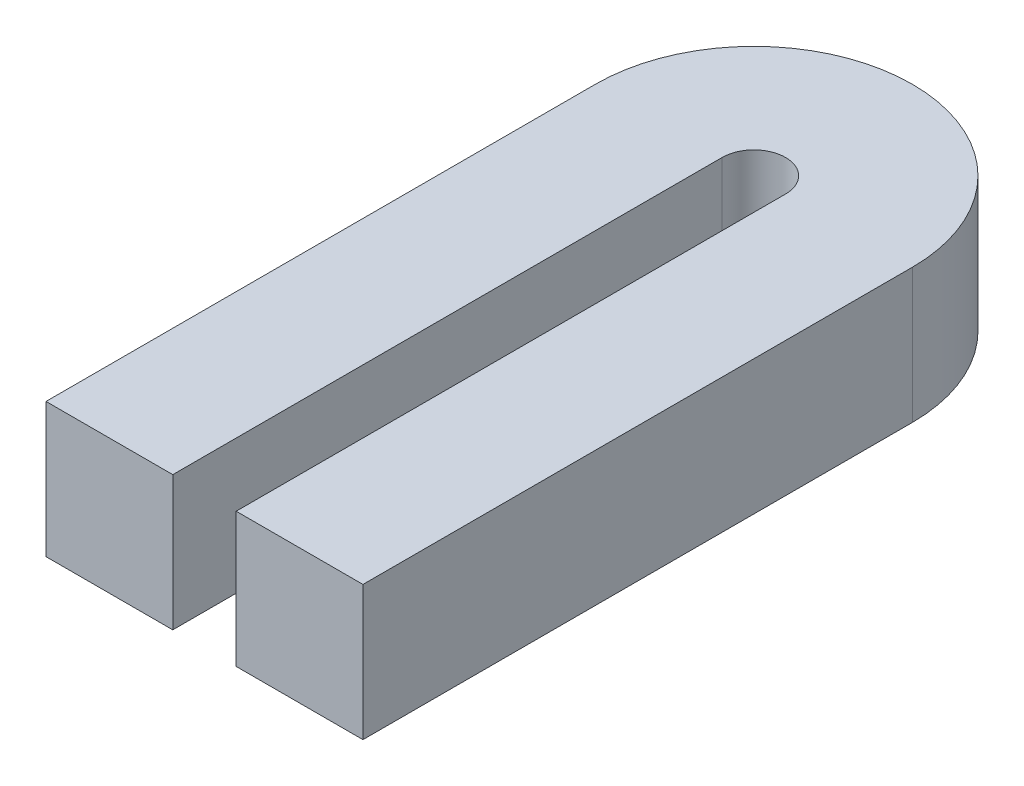
ISO-10303-21;
HEADER;
FILE_DESCRIPTION(('STEP AP214'),'2;1');
FILE_NAME('part.step','',(''),(''),'','','');
FILE_SCHEMA(('AUTOMOTIVE_DESIGN { 1 0 10303 214 1 1 1 1 }'));
ENDSEC;
DATA;
#1=APPLICATION_CONTEXT('core data for automotive mechanical design processes');
#2=APPLICATION_PROTOCOL_DEFINITION('international standard','automotive_design',2000,#1);
#3=PRODUCT_CONTEXT('',#1,'mechanical');
#4=PRODUCT('Part','Part','',(#3));
#5=PRODUCT_RELATED_PRODUCT_CATEGORY('part','',(#4));
#6=PRODUCT_DEFINITION_FORMATION('','',#4);
#7=PRODUCT_DEFINITION_CONTEXT('part definition',#1,'design');
#8=PRODUCT_DEFINITION('design','',#6,#7);
#9=PRODUCT_DEFINITION_SHAPE('','',#8);
#10=(LENGTH_UNIT() NAMED_UNIT(*) SI_UNIT(.MILLI.,.METRE.));
#11=(NAMED_UNIT(*) PLANE_ANGLE_UNIT() SI_UNIT($,.RADIAN.));
#12=(NAMED_UNIT(*) SI_UNIT($,.STERADIAN.) SOLID_ANGLE_UNIT());
#13=UNCERTAINTY_MEASURE_WITH_UNIT(LENGTH_MEASURE(1.E-05),#10,'distance_accuracy_value','');
#14=(GEOMETRIC_REPRESENTATION_CONTEXT(3) GLOBAL_UNCERTAINTY_ASSIGNED_CONTEXT((#13)) GLOBAL_UNIT_ASSIGNED_CONTEXT((#10,
#11,#12)) REPRESENTATION_CONTEXT('',''));
#15=CARTESIAN_POINT('',(0.,0.,0.));
#16=DIRECTION('',(0.,0.,1.));
#17=DIRECTION('',(1.,0.,0.));
#18=AXIS2_PLACEMENT_3D('',#15,#16,#17);
#19=CARTESIAN_POINT('',(826.359351708081,-71.,1307.32813603752));
#20=DIRECTION('',(1.,0.,0.));
#21=DIRECTION('',(0.,0.,-1.));
#22=AXIS2_PLACEMENT_3D('',#19,#20,#21);
#23=PLANE('',#22);
#24=DIRECTION('',(0.,0.,1.));
#25=VECTOR('',#24,1.);
#26=CARTESIAN_POINT('',(826.359351708081,-79.,1307.32813603752));
#27=LINE('',#26,#25);
#28=CARTESIAN_POINT('',(826.359351708081,-79.,1307.32813603752));
#29=VERTEX_POINT('',#28);
#30=CARTESIAN_POINT('',(826.359351708081,-79.,1340.0191783547));
#31=VERTEX_POINT('',#30);
#32=EDGE_CURVE('E87',#29,#31,#27,.T.);
#33=ORIENTED_EDGE('',*,*,#32,.T.);
#34=DIRECTION('',(0.,-1.,0.));
#35=VECTOR('',#34,1.);
#36=CARTESIAN_POINT('',(826.359351708081,-71.,1340.0191783547));
#37=LINE('',#36,#35);
#38=CARTESIAN_POINT('',(826.359351708081,-71.,1340.0191783547));
#39=VERTEX_POINT('',#38);
#40=EDGE_CURVE('E11',#39,#31,#37,.T.);
#41=ORIENTED_EDGE('',*,*,#40,.F.);
#42=DIRECTION('',(0.,0.,1.));
#43=VECTOR('',#42,1.);
#44=CARTESIAN_POINT('',(826.359351708081,-71.,1307.32813603752));
#45=LINE('',#44,#43);
#46=CARTESIAN_POINT('',(826.359351708081,-71.,1307.32813603752));
#47=VERTEX_POINT('',#46);
#48=EDGE_CURVE('E106',#47,#39,#45,.T.);
#49=ORIENTED_EDGE('',*,*,#48,.F.);
#50=DIRECTION('',(0.,-1.,0.));
#51=VECTOR('',#50,1.);
#52=CARTESIAN_POINT('',(826.359351708081,-71.,1307.32813603752));
#53=LINE('',#52,#51);
#54=EDGE_CURVE('E30',#47,#29,#53,.T.);
#55=ORIENTED_EDGE('',*,*,#54,.T.);
#56=EDGE_LOOP('',(#33,#41,#49,#55));
#57=FACE_BOUND('',#56,.T.);
#58=ADVANCED_FACE('F16',(#57),#23,.F.);
#59=CARTESIAN_POINT('',(826.359351708081,-71.,1340.0191783547));
#60=DIRECTION('',(0.,0.,-1.));
#61=DIRECTION('',(-1.,0.,0.));
#62=AXIS2_PLACEMENT_3D('',#59,#60,#61);
#63=PLANE('',#62);
#64=DIRECTION('',(1.,0.,0.));
#65=VECTOR('',#64,1.);
#66=CARTESIAN_POINT('',(826.359351708081,-79.,1340.0191783547));
#67=LINE('',#66,#65);
#68=CARTESIAN_POINT('',(833.90343839666,-79.,1340.0191783547));
#69=VERTEX_POINT('',#68);
#70=EDGE_CURVE('E83',#31,#69,#67,.T.);
#71=ORIENTED_EDGE('',*,*,#70,.T.);
#72=DIRECTION('',(0.,-1.,0.));
#73=VECTOR('',#72,1.);
#74=CARTESIAN_POINT('',(833.90343839666,-71.,1340.0191783547));
#75=LINE('',#74,#73);
#76=CARTESIAN_POINT('',(833.90343839666,-71.,1340.0191783547));
#77=VERTEX_POINT('',#76);
#78=EDGE_CURVE('E23',#77,#69,#75,.T.);
#79=ORIENTED_EDGE('',*,*,#78,.F.);
#80=DIRECTION('',(1.,0.,0.));
#81=VECTOR('',#80,1.);
#82=CARTESIAN_POINT('',(826.359351708081,-71.,1340.0191783547));
#83=LINE('',#82,#81);
#84=EDGE_CURVE('E96',#39,#77,#83,.T.);
#85=ORIENTED_EDGE('',*,*,#84,.F.);
#86=ORIENTED_EDGE('',*,*,#40,.T.);
#87=EDGE_LOOP('',(#71,#79,#85,#86));
#88=FACE_BOUND('',#87,.T.);
#89=ADVANCED_FACE('F95',(#88),#63,.F.);
#90=CARTESIAN_POINT('',(833.90343839666,-71.,1307.32813603752));
#91=DIRECTION('',(1.,0.,0.));
#92=DIRECTION('',(0.,0.,-1.));
#93=AXIS2_PLACEMENT_3D('',#90,#91,#92);
#94=PLANE('',#93);
#95=DIRECTION('',(0.,0.,1.));
#96=VECTOR('',#95,1.);
#97=CARTESIAN_POINT('',(833.90343839666,-79.,1307.32813603752));
#98=LINE('',#97,#96);
#99=CARTESIAN_POINT('',(833.90343839666,-79.,1307.32813603752));
#100=VERTEX_POINT('',#99);
#101=EDGE_CURVE('E90',#100,#69,#98,.T.);
#102=ORIENTED_EDGE('',*,*,#101,.F.);
#103=DIRECTION('',(0.,-1.,0.));
#104=VECTOR('',#103,1.);
#105=CARTESIAN_POINT('',(833.90343839666,-71.,1307.32813603752));
#106=LINE('',#105,#104);
#107=CARTESIAN_POINT('',(833.90343839666,-71.,1307.32813603752));
#108=VERTEX_POINT('',#107);
#109=EDGE_CURVE('E130',#108,#100,#106,.T.);
#110=ORIENTED_EDGE('',*,*,#109,.F.);
#111=DIRECTION('',(0.,0.,1.));
#112=VECTOR('',#111,1.);
#113=CARTESIAN_POINT('',(833.90343839666,-71.,1307.32813603752));
#114=LINE('',#113,#112);
#115=EDGE_CURVE('E105',#108,#77,#114,.T.);
#116=ORIENTED_EDGE('',*,*,#115,.T.);
#117=ORIENTED_EDGE('',*,*,#78,.T.);
#118=EDGE_LOOP('',(#102,#110,#116,#117));
#119=FACE_BOUND('',#118,.T.);
#120=ADVANCED_FACE('F132',(#119),#94,.T.);
#121=CARTESIAN_POINT('',(835.789460068805,-71.,1307.32813603752));
#122=DIRECTION('',(0.,-1.,0.));
#123=DIRECTION('',(0.,0.,-1.));
#124=AXIS2_PLACEMENT_3D('',#121,#122,#123);
#125=CYLINDRICAL_SURFACE('',#124,1.88602167214489);
#126=CARTESIAN_POINT('',(835.789460068805,-79.,1307.32813603752));
#127=DIRECTION('',(0.,-1.,0.));
#128=DIRECTION('',(1.,0.,0.));
#129=AXIS2_PLACEMENT_3D('',#126,#127,#128);
#130=CIRCLE('',#129,1.88602167214489);
#131=CARTESIAN_POINT('',(837.67548174095,-79.,1307.32813603752));
#132=VERTEX_POINT('',#131);
#133=EDGE_CURVE('E151',#100,#132,#130,.T.);
#134=ORIENTED_EDGE('',*,*,#133,.T.);
#135=DIRECTION('',(0.,-1.,0.));
#136=VECTOR('',#135,1.);
#137=CARTESIAN_POINT('',(837.67548174095,-71.,1307.32813603752));
#138=LINE('',#137,#136);
#139=CARTESIAN_POINT('',(837.67548174095,-71.,1307.32813603752));
#140=VERTEX_POINT('',#139);
#141=EDGE_CURVE('E127',#140,#132,#138,.T.);
#142=ORIENTED_EDGE('',*,*,#141,.F.);
#143=CARTESIAN_POINT('',(835.789460068805,-71.,1307.32813603752));
#144=DIRECTION('',(0.,-1.,0.));
#145=DIRECTION('',(1.,0.,0.));
#146=AXIS2_PLACEMENT_3D('',#143,#144,#145);
#147=CIRCLE('',#146,1.88602167214489);
#148=EDGE_CURVE('E109',#108,#140,#147,.T.);
#149=ORIENTED_EDGE('',*,*,#148,.F.);
#150=ORIENTED_EDGE('',*,*,#109,.T.);
#151=EDGE_LOOP('',(#134,#142,#149,#150));
#152=FACE_BOUND('',#151,.T.);
#153=ADVANCED_FACE('F154',(#152),#125,.F.);
#154=CARTESIAN_POINT('',(837.67548174095,-71.,1307.32813603752));
#155=DIRECTION('',(1.,0.,0.));
#156=DIRECTION('',(0.,0.,-1.));
#157=AXIS2_PLACEMENT_3D('',#154,#155,#156);
#158=PLANE('',#157);
#159=DIRECTION('',(0.,0.,1.));
#160=VECTOR('',#159,1.);
#161=CARTESIAN_POINT('',(837.67548174095,-79.,1307.32813603752));
#162=LINE('',#161,#160);
#163=CARTESIAN_POINT('',(837.67548174095,-79.,1340.0191783547));
#164=VERTEX_POINT('',#163);
#165=EDGE_CURVE('E147',#132,#164,#162,.T.);
#166=ORIENTED_EDGE('',*,*,#165,.T.);
#167=DIRECTION('',(0.,-1.,0.));
#168=VECTOR('',#167,1.);
#169=CARTESIAN_POINT('',(837.67548174095,-71.,1340.0191783547));
#170=LINE('',#169,#168);
#171=CARTESIAN_POINT('',(837.67548174095,-71.,1340.0191783547));
#172=VERTEX_POINT('',#171);
#173=EDGE_CURVE('E124',#172,#164,#170,.T.);
#174=ORIENTED_EDGE('',*,*,#173,.F.);
#175=DIRECTION('',(0.,0.,1.));
#176=VECTOR('',#175,1.);
#177=CARTESIAN_POINT('',(837.67548174095,-71.,1307.32813603752));
#178=LINE('',#177,#176);
#179=EDGE_CURVE('E111',#140,#172,#178,.T.);
#180=ORIENTED_EDGE('',*,*,#179,.F.);
#181=ORIENTED_EDGE('',*,*,#141,.T.);
#182=EDGE_LOOP('',(#166,#174,#180,#181));
#183=FACE_BOUND('',#182,.T.);
#184=ADVANCED_FACE('F158',(#183),#158,.F.);
#185=CARTESIAN_POINT('',(837.67548174095,-71.,1340.0191783547));
#186=DIRECTION('',(0.,0.,-1.));
#187=DIRECTION('',(-1.,0.,0.));
#188=AXIS2_PLACEMENT_3D('',#185,#186,#187);
#189=PLANE('',#188);
#190=DIRECTION('',(1.,0.,0.));
#191=VECTOR('',#190,1.);
#192=CARTESIAN_POINT('',(837.67548174095,-79.,1340.0191783547));
#193=LINE('',#192,#191);
#194=CARTESIAN_POINT('',(845.219568429529,-79.,1340.0191783547));
#195=VERTEX_POINT('',#194);
#196=EDGE_CURVE('E146',#164,#195,#193,.T.);
#197=ORIENTED_EDGE('',*,*,#196,.T.);
#198=DIRECTION('',(0.,-1.,0.));
#199=VECTOR('',#198,1.);
#200=CARTESIAN_POINT('',(845.219568429529,-71.,1340.0191783547));
#201=LINE('',#200,#199);
#202=CARTESIAN_POINT('',(845.219568429529,-71.,1340.0191783547));
#203=VERTEX_POINT('',#202);
#204=EDGE_CURVE('E122',#203,#195,#201,.T.);
#205=ORIENTED_EDGE('',*,*,#204,.F.);
#206=DIRECTION('',(1.,0.,0.));
#207=VECTOR('',#206,1.);
#208=CARTESIAN_POINT('',(837.67548174095,-71.,1340.0191783547));
#209=LINE('',#208,#207);
#210=EDGE_CURVE('E113',#172,#203,#209,.T.);
#211=ORIENTED_EDGE('',*,*,#210,.F.);
#212=ORIENTED_EDGE('',*,*,#173,.T.);
#213=EDGE_LOOP('',(#197,#205,#211,#212));
#214=FACE_BOUND('',#213,.T.);
#215=ADVANCED_FACE('F161',(#214),#189,.F.);
#216=CARTESIAN_POINT('',(845.219568429529,-71.,1307.32813603752));
#217=DIRECTION('',(1.,0.,0.));
#218=DIRECTION('',(0.,0.,-1.));
#219=AXIS2_PLACEMENT_3D('',#216,#217,#218);
#220=PLANE('',#219);
#221=DIRECTION('',(0.,0.,1.));
#222=VECTOR('',#221,1.);
#223=CARTESIAN_POINT('',(845.219568429529,-79.,1307.32813603752));
#224=LINE('',#223,#222);
#225=CARTESIAN_POINT('',(845.219568429529,-79.,1307.32813603752));
#226=VERTEX_POINT('',#225);
#227=EDGE_CURVE('E141',#226,#195,#224,.T.);
#228=ORIENTED_EDGE('',*,*,#227,.F.);
#229=DIRECTION('',(0.,-1.,0.));
#230=VECTOR('',#229,1.);
#231=CARTESIAN_POINT('',(845.219568429529,-71.,1307.32813603752));
#232=LINE('',#231,#230);
#233=CARTESIAN_POINT('',(845.219568429529,-71.,1307.32813603752));
#234=VERTEX_POINT('',#233);
#235=EDGE_CURVE('E38',#234,#226,#232,.T.);
#236=ORIENTED_EDGE('',*,*,#235,.F.);
#237=DIRECTION('',(0.,0.,1.));
#238=VECTOR('',#237,1.);
#239=CARTESIAN_POINT('',(845.219568429529,-71.,1307.32813603752));
#240=LINE('',#239,#238);
#241=EDGE_CURVE('E115',#234,#203,#240,.T.);
#242=ORIENTED_EDGE('',*,*,#241,.T.);
#243=ORIENTED_EDGE('',*,*,#204,.T.);
#244=EDGE_LOOP('',(#228,#236,#242,#243));
#245=FACE_BOUND('',#244,.T.);
#246=ADVANCED_FACE('F142',(#245),#220,.T.);
#247=CARTESIAN_POINT('',(835.789460068805,-71.,1307.32813603752));
#248=DIRECTION('',(0.,-1.,0.));
#249=DIRECTION('',(0.,0.,-1.));
#250=AXIS2_PLACEMENT_3D('',#247,#248,#249);
#251=CYLINDRICAL_SURFACE('',#250,9.43010836072444);
#252=CARTESIAN_POINT('',(835.789460068805,-79.,1307.32813603752));
#253=DIRECTION('',(0.,-1.,0.));
#254=DIRECTION('',(1.,0.,0.));
#255=AXIS2_PLACEMENT_3D('',#252,#253,#254);
#256=CIRCLE('',#255,9.43010836072444);
#257=EDGE_CURVE('E102',#29,#226,#256,.T.);
#258=ORIENTED_EDGE('',*,*,#257,.F.);
#259=ORIENTED_EDGE('',*,*,#54,.F.);
#260=CARTESIAN_POINT('',(835.789460068805,-71.,1307.32813603752));
#261=DIRECTION('',(0.,-1.,0.));
#262=DIRECTION('',(1.,0.,0.));
#263=AXIS2_PLACEMENT_3D('',#260,#261,#262);
#264=CIRCLE('',#263,9.43010836072444);
#265=EDGE_CURVE('E117',#47,#234,#264,.T.);
#266=ORIENTED_EDGE('',*,*,#265,.T.);
#267=ORIENTED_EDGE('',*,*,#235,.T.);
#268=EDGE_LOOP('',(#258,#259,#266,#267));
#269=FACE_BOUND('',#268,.T.);
#270=ADVANCED_FACE('F139',(#269),#251,.T.);
#271=CARTESIAN_POINT('',(835.789460068805,-71.,1307.32813603752));
#272=DIRECTION('',(0.,-1.,0.));
#273=DIRECTION('',(0.,0.,-1.));
#274=AXIS2_PLACEMENT_3D('',#271,#272,#273);
#275=PLANE('',#274);
#276=ORIENTED_EDGE('',*,*,#48,.T.);
#277=ORIENTED_EDGE('',*,*,#84,.T.);
#278=ORIENTED_EDGE('',*,*,#115,.F.);
#279=ORIENTED_EDGE('',*,*,#148,.T.);
#280=ORIENTED_EDGE('',*,*,#179,.T.);
#281=ORIENTED_EDGE('',*,*,#210,.T.);
#282=ORIENTED_EDGE('',*,*,#241,.F.);
#283=ORIENTED_EDGE('',*,*,#265,.F.);
#284=EDGE_LOOP('',(#276,#277,#278,#279,#280,#281,#282,#283));
#285=FACE_BOUND('',#284,.T.);
#286=ADVANCED_FACE('F136',(#285),#275,.F.);
#287=CARTESIAN_POINT('',(835.789460068805,-79.,1307.32813603752));
#288=DIRECTION('',(0.,-1.,0.));
#289=DIRECTION('',(0.,0.,-1.));
#290=AXIS2_PLACEMENT_3D('',#287,#288,#289);
#291=PLANE('',#290);
#292=ORIENTED_EDGE('',*,*,#32,.F.);
#293=ORIENTED_EDGE('',*,*,#257,.T.);
#294=ORIENTED_EDGE('',*,*,#227,.T.);
#295=ORIENTED_EDGE('',*,*,#196,.F.);
#296=ORIENTED_EDGE('',*,*,#165,.F.);
#297=ORIENTED_EDGE('',*,*,#133,.F.);
#298=ORIENTED_EDGE('',*,*,#101,.T.);
#299=ORIENTED_EDGE('',*,*,#70,.F.);
#300=EDGE_LOOP('',(#292,#293,#294,#295,#296,#297,#298,#299));
#301=FACE_BOUND('',#300,.T.);
#302=ADVANCED_FACE('F84',(#301),#291,.T.);
#303=CLOSED_SHELL('',(#58,#89,#120,#153,#184,#215,#246,#270,#286,#302));
#304=MANIFOLD_SOLID_BREP('B1',#303);
#305=ADVANCED_BREP_SHAPE_REPRESENTATION('',(#18,#304),#14);
#306=SHAPE_DEFINITION_REPRESENTATION(#9,#305);
ENDSEC;
END-ISO-10303-21;
